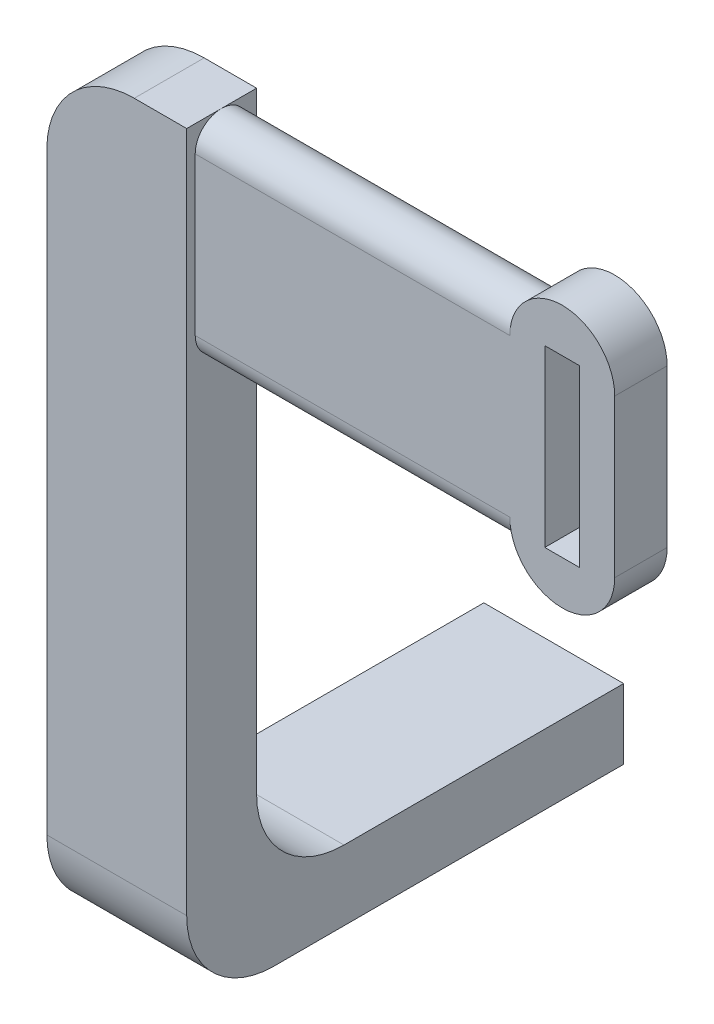
ISO-10303-21;
HEADER;
FILE_DESCRIPTION(('STEP AP214'),'2;1');
FILE_NAME('part.step','',(''),(''),'','','');
FILE_SCHEMA(('AUTOMOTIVE_DESIGN { 1 0 10303 214 1 1 1 1 }'));
ENDSEC;
DATA;
#1=APPLICATION_CONTEXT('core data for automotive mechanical design processes');
#2=APPLICATION_PROTOCOL_DEFINITION('international standard','automotive_design',2000,#1);
#3=PRODUCT_CONTEXT('',#1,'mechanical');
#4=PRODUCT('Part','Part','',(#3));
#5=PRODUCT_RELATED_PRODUCT_CATEGORY('part','',(#4));
#6=PRODUCT_DEFINITION_FORMATION('','',#4);
#7=PRODUCT_DEFINITION_CONTEXT('part definition',#1,'design');
#8=PRODUCT_DEFINITION('design','',#6,#7);
#9=PRODUCT_DEFINITION_SHAPE('','',#8);
#10=(LENGTH_UNIT() NAMED_UNIT(*) SI_UNIT(.MILLI.,.METRE.));
#11=(NAMED_UNIT(*) PLANE_ANGLE_UNIT() SI_UNIT($,.RADIAN.));
#12=(NAMED_UNIT(*) SI_UNIT($,.STERADIAN.) SOLID_ANGLE_UNIT());
#13=UNCERTAINTY_MEASURE_WITH_UNIT(LENGTH_MEASURE(1.E-05),#10,'distance_accuracy_value','');
#14=(GEOMETRIC_REPRESENTATION_CONTEXT(3) GLOBAL_UNCERTAINTY_ASSIGNED_CONTEXT((#13)) GLOBAL_UNIT_ASSIGNED_CONTEXT((#10,
#11,#12)) REPRESENTATION_CONTEXT('',''));
#15=CARTESIAN_POINT('',(0.,0.,0.));
#16=DIRECTION('',(0.,0.,1.));
#17=DIRECTION('',(1.,0.,0.));
#18=AXIS2_PLACEMENT_3D('',#15,#16,#17);
#19=CARTESIAN_POINT('',(50.,81.,49.0252352163252));
#20=DIRECTION('',(0.,0.,-1.));
#21=DIRECTION('',(-1.,0.,0.));
#22=AXIS2_PLACEMENT_3D('',#19,#20,#21);
#23=PLANE('',#22);
#24=CARTESIAN_POINT('',(50.,81.,49.0252352163253));
#25=DIRECTION('',(0.,0.,-1.));
#26=DIRECTION('',(0.,1.,0.));
#27=AXIS2_PLACEMENT_3D('',#24,#25,#26);
#28=CIRCLE('',#27,6.);
#29=CARTESIAN_POINT('',(44.,81.,49.0252352163252));
#30=VERTEX_POINT('',#29);
#31=CARTESIAN_POINT('',(56.,81.,49.0252352163253));
#32=VERTEX_POINT('',#31);
#33=EDGE_CURVE('E239',#30,#32,#28,.T.);
#34=ORIENTED_EDGE('',*,*,#33,.F.);
#35=DIRECTION('',(-1.,0.,0.));
#36=VECTOR('',#35,1.);
#37=CARTESIAN_POINT('',(50.,81.,49.0252352163252));
#38=LINE('',#37,#36);
#39=CARTESIAN_POINT('',(8.,81.,49.0252352163252));
#40=VERTEX_POINT('',#39);
#41=EDGE_CURVE('E396',#30,#40,#38,.T.);
#42=ORIENTED_EDGE('',*,*,#41,.T.);
#43=DIRECTION('',(0.,-1.,0.));
#44=VECTOR('',#43,1.);
#45=CARTESIAN_POINT('',(8.,81.,49.0252352163252));
#46=LINE('',#45,#44);
#47=CARTESIAN_POINT('',(8.,63.,49.0252352163252));
#48=VERTEX_POINT('',#47);
#49=EDGE_CURVE('E340',#40,#48,#46,.T.);
#50=ORIENTED_EDGE('',*,*,#49,.T.);
#51=DIRECTION('',(-1.,0.,0.));
#52=VECTOR('',#51,1.);
#53=CARTESIAN_POINT('',(50.,63.,49.0252352163252));
#54=LINE('',#53,#52);
#55=CARTESIAN_POINT('',(44.,63.,49.0252352163252));
#56=VERTEX_POINT('',#55);
#57=EDGE_CURVE('E336',#56,#48,#54,.T.);
#58=ORIENTED_EDGE('',*,*,#57,.F.);
#59=CARTESIAN_POINT('',(50.,63.,49.0252352163253));
#60=DIRECTION('',(0.,0.,-1.));
#61=DIRECTION('',(0.,1.,0.));
#62=AXIS2_PLACEMENT_3D('',#59,#60,#61);
#63=CIRCLE('',#62,6.);
#64=CARTESIAN_POINT('',(56.,63.,49.0252352163253));
#65=VERTEX_POINT('',#64);
#66=EDGE_CURVE('E236',#65,#56,#63,.T.);
#67=ORIENTED_EDGE('',*,*,#66,.F.);
#68=DIRECTION('',(0.,-1.,0.));
#69=VECTOR('',#68,1.);
#70=CARTESIAN_POINT('',(56.,63.,49.0252352163253));
#71=LINE('',#70,#69);
#72=EDGE_CURVE('E243',#32,#65,#71,.T.);
#73=ORIENTED_EDGE('',*,*,#72,.F.);
#74=EDGE_LOOP('',(#34,#42,#50,#58,#67,#73));
#75=FACE_BOUND('',#74,.T.);
#76=DIRECTION('',(1.,0.,0.));
#77=VECTOR('',#76,1.);
#78=CARTESIAN_POINT('',(48.,82.,49.0252352163252));
#79=LINE('',#78,#77);
#80=CARTESIAN_POINT('',(48.,82.,49.0252352163252));
#81=VERTEX_POINT('',#80);
#82=CARTESIAN_POINT('',(52.,82.,49.0252352163252));
#83=VERTEX_POINT('',#82);
#84=EDGE_CURVE('E224',#81,#83,#79,.T.);
#85=ORIENTED_EDGE('',*,*,#84,.T.);
#86=DIRECTION('',(0.,-1.,0.));
#87=VECTOR('',#86,1.);
#88=CARTESIAN_POINT('',(52.,82.,49.0252352163252));
#89=LINE('',#88,#87);
#90=CARTESIAN_POINT('',(52.,62.,49.0252352163252));
#91=VERTEX_POINT('',#90);
#92=EDGE_CURVE('E212',#83,#91,#89,.T.);
#93=ORIENTED_EDGE('',*,*,#92,.T.);
#94=DIRECTION('',(1.,0.,0.));
#95=VECTOR('',#94,1.);
#96=CARTESIAN_POINT('',(48.,62.,49.0252352163252));
#97=LINE('',#96,#95);
#98=CARTESIAN_POINT('',(48.,62.,49.0252352163252));
#99=VERTEX_POINT('',#98);
#100=EDGE_CURVE('E227',#99,#91,#97,.T.);
#101=ORIENTED_EDGE('',*,*,#100,.F.);
#102=DIRECTION('',(0.,-1.,0.));
#103=VECTOR('',#102,1.);
#104=CARTESIAN_POINT('',(48.,82.,49.0252352163252));
#105=LINE('',#104,#103);
#106=EDGE_CURVE('E206',#81,#99,#105,.T.);
#107=ORIENTED_EDGE('',*,*,#106,.F.);
#108=EDGE_LOOP('',(#85,#93,#101,#107));
#109=FACE_BOUND('',#108,.T.);
#110=ADVANCED_FACE('F38',(#75,#109),#23,.F.);
#111=CARTESIAN_POINT('',(50.,81.,43.0252352163252));
#112=DIRECTION('',(0.,0.,1.));
#113=DIRECTION('',(1.,0.,0.));
#114=AXIS2_PLACEMENT_3D('',#111,#112,#113);
#115=PLANE('',#114);
#116=DIRECTION('',(-1.,0.,0.));
#117=VECTOR('',#116,1.);
#118=CARTESIAN_POINT('',(50.,81.,43.0252352163252));
#119=LINE('',#118,#117);
#120=CARTESIAN_POINT('',(44.,81.,43.0252352163252));
#121=VERTEX_POINT('',#120);
#122=CARTESIAN_POINT('',(8.,81.,43.0252352163252));
#123=VERTEX_POINT('',#122);
#124=EDGE_CURVE('E331',#121,#123,#119,.T.);
#125=ORIENTED_EDGE('',*,*,#124,.F.);
#126=CARTESIAN_POINT('',(50.,81.,43.0252352163253));
#127=DIRECTION('',(0.,0.,-1.));
#128=DIRECTION('',(0.,1.,0.));
#129=AXIS2_PLACEMENT_3D('',#126,#127,#128);
#130=CIRCLE('',#129,6.);
#131=CARTESIAN_POINT('',(56.,81.,43.0252352163253));
#132=VERTEX_POINT('',#131);
#133=EDGE_CURVE('E249',#121,#132,#130,.T.);
#134=ORIENTED_EDGE('',*,*,#133,.T.);
#135=DIRECTION('',(0.,-1.,0.));
#136=VECTOR('',#135,1.);
#137=CARTESIAN_POINT('',(56.,63.,43.0252352163253));
#138=LINE('',#137,#136);
#139=CARTESIAN_POINT('',(56.,63.,43.0252352163253));
#140=VERTEX_POINT('',#139);
#141=EDGE_CURVE('E240',#132,#140,#138,.T.);
#142=ORIENTED_EDGE('',*,*,#141,.T.);
#143=CARTESIAN_POINT('',(50.,63.,43.0252352163253));
#144=DIRECTION('',(0.,0.,-1.));
#145=DIRECTION('',(0.,1.,0.));
#146=AXIS2_PLACEMENT_3D('',#143,#144,#145);
#147=CIRCLE('',#146,6.);
#148=CARTESIAN_POINT('',(44.,63.,43.0252352163252));
#149=VERTEX_POINT('',#148);
#150=EDGE_CURVE('E213',#140,#149,#147,.T.);
#151=ORIENTED_EDGE('',*,*,#150,.T.);
#152=DIRECTION('',(-1.,0.,0.));
#153=VECTOR('',#152,1.);
#154=CARTESIAN_POINT('',(50.,63.,43.0252352163252));
#155=LINE('',#154,#153);
#156=CARTESIAN_POINT('',(8.,63.,43.0252352163252));
#157=VERTEX_POINT('',#156);
#158=EDGE_CURVE('E534',#149,#157,#155,.T.);
#159=ORIENTED_EDGE('',*,*,#158,.T.);
#160=DIRECTION('',(0.,1.,0.));
#161=VECTOR('',#160,1.);
#162=CARTESIAN_POINT('',(8.,81.,43.0252352163252));
#163=LINE('',#162,#161);
#164=EDGE_CURVE('E529',#157,#123,#163,.T.);
#165=ORIENTED_EDGE('',*,*,#164,.T.);
#166=EDGE_LOOP('',(#125,#134,#142,#151,#159,#165));
#167=FACE_BOUND('',#166,.T.);
#168=DIRECTION('',(1.,0.,0.));
#169=VECTOR('',#168,1.);
#170=CARTESIAN_POINT('',(48.,82.,43.0252352163252));
#171=LINE('',#170,#169);
#172=CARTESIAN_POINT('',(48.,82.,43.0252352163252));
#173=VERTEX_POINT('',#172);
#174=CARTESIAN_POINT('',(52.,82.,43.0252352163252));
#175=VERTEX_POINT('',#174);
#176=EDGE_CURVE('E194',#173,#175,#171,.T.);
#177=ORIENTED_EDGE('',*,*,#176,.F.);
#178=DIRECTION('',(0.,-1.,0.));
#179=VECTOR('',#178,1.);
#180=CARTESIAN_POINT('',(48.,82.,43.0252352163252));
#181=LINE('',#180,#179);
#182=CARTESIAN_POINT('',(48.,62.,43.0252352163252));
#183=VERTEX_POINT('',#182);
#184=EDGE_CURVE('E220',#173,#183,#181,.T.);
#185=ORIENTED_EDGE('',*,*,#184,.T.);
#186=DIRECTION('',(1.,0.,0.));
#187=VECTOR('',#186,1.);
#188=CARTESIAN_POINT('',(48.,62.,43.0252352163252));
#189=LINE('',#188,#187);
#190=CARTESIAN_POINT('',(52.,62.,43.0252352163252));
#191=VERTEX_POINT('',#190);
#192=EDGE_CURVE('E218',#183,#191,#189,.T.);
#193=ORIENTED_EDGE('',*,*,#192,.T.);
#194=DIRECTION('',(0.,-1.,0.));
#195=VECTOR('',#194,1.);
#196=CARTESIAN_POINT('',(52.,82.,43.0252352163252));
#197=LINE('',#196,#195);
#198=EDGE_CURVE('E205',#175,#191,#197,.T.);
#199=ORIENTED_EDGE('',*,*,#198,.F.);
#200=EDGE_LOOP('',(#177,#185,#193,#199));
#201=FACE_BOUND('',#200,.T.);
#202=ADVANCED_FACE('F217',(#167,#201),#115,.F.);
#203=CARTESIAN_POINT('',(-8.,-4.,50.));
#204=DIRECTION('',(0.,1.,0.));
#205=DIRECTION('',(0.,0.,1.));
#206=AXIS2_PLACEMENT_3D('',#203,#204,#205);
#207=PLANE('',#206);
#208=DIRECTION('',(0.,0.,-1.));
#209=VECTOR('',#208,1.);
#210=CARTESIAN_POINT('',(8.,-4.,50.));
#211=LINE('',#210,#209);
#212=CARTESIAN_POINT('',(8.,-4.,40.));
#213=VERTEX_POINT('',#212);
#214=CARTESIAN_POINT('',(8.,-4.,0.));
#215=VERTEX_POINT('',#214);
#216=EDGE_CURVE('E352',#213,#215,#211,.T.);
#217=ORIENTED_EDGE('',*,*,#216,.F.);
#218=DIRECTION('',(1.,0.,0.));
#219=VECTOR('',#218,1.);
#220=CARTESIAN_POINT('',(-8.,-4.,40.));
#221=LINE('',#220,#219);
#222=CARTESIAN_POINT('',(-8.,-4.,40.));
#223=VERTEX_POINT('',#222);
#224=EDGE_CURVE('E363',#213,#223,#221,.F.);
#225=ORIENTED_EDGE('',*,*,#224,.T.);
#226=DIRECTION('',(0.,0.,-1.));
#227=VECTOR('',#226,1.);
#228=CARTESIAN_POINT('',(-8.,-4.,50.));
#229=LINE('',#228,#227);
#230=CARTESIAN_POINT('',(-8.,-4.,0.));
#231=VERTEX_POINT('',#230);
#232=EDGE_CURVE('E348',#223,#231,#229,.T.);
#233=ORIENTED_EDGE('',*,*,#232,.T.);
#234=DIRECTION('',(1.,0.,0.));
#235=VECTOR('',#234,1.);
#236=CARTESIAN_POINT('',(-8.,-4.,0.));
#237=LINE('',#236,#235);
#238=CARTESIAN_POINT('',(-4.,-4.,0.));
#239=VERTEX_POINT('',#238);
#240=EDGE_CURVE('E447',#231,#239,#237,.T.);
#241=ORIENTED_EDGE('',*,*,#240,.T.);
#242=DIRECTION('',(0.,0.,1.));
#243=VECTOR('',#242,1.);
#244=CARTESIAN_POINT('',(-4.,-4.,0.));
#245=LINE('',#244,#243);
#246=CARTESIAN_POINT('',(-4.,-4.,25.));
#247=VERTEX_POINT('',#246);
#248=EDGE_CURVE('E409',#239,#247,#245,.T.);
#249=ORIENTED_EDGE('',*,*,#248,.T.);
#250=DIRECTION('',(1.,0.,0.));
#251=VECTOR('',#250,1.);
#252=CARTESIAN_POINT('',(-4.,-4.,25.));
#253=LINE('',#252,#251);
#254=CARTESIAN_POINT('',(4.,-4.,25.));
#255=VERTEX_POINT('',#254);
#256=EDGE_CURVE('E424',#247,#255,#253,.T.);
#257=ORIENTED_EDGE('',*,*,#256,.T.);
#258=DIRECTION('',(0.,0.,-1.));
#259=VECTOR('',#258,1.);
#260=CARTESIAN_POINT('',(4.,-4.,0.));
#261=LINE('',#260,#259);
#262=CARTESIAN_POINT('',(4.,-4.,0.));
#263=VERTEX_POINT('',#262);
#264=EDGE_CURVE('E414',#255,#263,#261,.T.);
#265=ORIENTED_EDGE('',*,*,#264,.T.);
#266=EDGE_CURVE('E446',#263,#215,#237,.T.);
#267=ORIENTED_EDGE('',*,*,#266,.T.);
#268=EDGE_LOOP('',(#217,#225,#233,#241,#249,#257,#265,#267));
#269=FACE_BOUND('',#268,.T.);
#270=ADVANCED_FACE('F291',(#269),#207,.F.);
#271=CARTESIAN_POINT('',(0.,0.,0.));
#272=DIRECTION('',(0.,0.,1.));
#273=DIRECTION('',(1.,0.,0.));
#274=AXIS2_PLACEMENT_3D('',#271,#272,#273);
#275=PLANE('',#274);
#276=DIRECTION('',(0.,-1.,0.));
#277=VECTOR('',#276,1.);
#278=CARTESIAN_POINT('',(-4.,1.,0.));
#279=LINE('',#278,#277);
#280=CARTESIAN_POINT('',(-4.,1.,0.));
#281=VERTEX_POINT('',#280);
#282=EDGE_CURVE('E421',#281,#239,#279,.T.);
#283=ORIENTED_EDGE('',*,*,#282,.T.);
#284=ORIENTED_EDGE('',*,*,#240,.F.);
#285=DIRECTION('',(0.,-1.,0.));
#286=VECTOR('',#285,1.);
#287=CARTESIAN_POINT('',(-8.,4.,0.));
#288=LINE('',#287,#286);
#289=CARTESIAN_POINT('',(-8.,4.,0.));
#290=VERTEX_POINT('',#289);
#291=EDGE_CURVE('E438',#290,#231,#288,.T.);
#292=ORIENTED_EDGE('',*,*,#291,.F.);
#293=DIRECTION('',(1.,0.,0.));
#294=VECTOR('',#293,1.);
#295=CARTESIAN_POINT('',(-8.,4.,0.));
#296=LINE('',#295,#294);
#297=CARTESIAN_POINT('',(8.,4.,0.));
#298=VERTEX_POINT('',#297);
#299=EDGE_CURVE('E441',#290,#298,#296,.T.);
#300=ORIENTED_EDGE('',*,*,#299,.T.);
#301=DIRECTION('',(0.,-1.,0.));
#302=VECTOR('',#301,1.);
#303=CARTESIAN_POINT('',(8.,4.,0.));
#304=LINE('',#303,#302);
#305=EDGE_CURVE('E449',#298,#215,#304,.T.);
#306=ORIENTED_EDGE('',*,*,#305,.T.);
#307=ORIENTED_EDGE('',*,*,#266,.F.);
#308=DIRECTION('',(0.,-1.,0.));
#309=VECTOR('',#308,1.);
#310=CARTESIAN_POINT('',(4.,1.,0.));
#311=LINE('',#310,#309);
#312=CARTESIAN_POINT('',(4.,1.,0.));
#313=VERTEX_POINT('',#312);
#314=EDGE_CURVE('E431',#313,#263,#311,.T.);
#315=ORIENTED_EDGE('',*,*,#314,.F.);
#316=DIRECTION('',(-1.,0.,0.));
#317=VECTOR('',#316,1.);
#318=CARTESIAN_POINT('',(-4.,1.,0.));
#319=LINE('',#318,#317);
#320=EDGE_CURVE('E418',#313,#281,#319,.T.);
#321=ORIENTED_EDGE('',*,*,#320,.T.);
#322=EDGE_LOOP('',(#283,#284,#292,#300,#306,#307,#315,#321));
#323=FACE_BOUND('',#322,.T.);
#324=ADVANCED_FACE('F469',(#323),#275,.F.);
#325=CARTESIAN_POINT('',(-8.,4.,50.));
#326=DIRECTION('',(1.,0.,0.));
#327=DIRECTION('',(0.,0.,-1.));
#328=AXIS2_PLACEMENT_3D('',#325,#326,#327);
#329=PLANE('',#328);
#330=DIRECTION('',(0.,-1.,0.));
#331=VECTOR('',#330,1.);
#332=CARTESIAN_POINT('',(-8.,4.,50.));
#333=LINE('',#332,#331);
#334=CARTESIAN_POINT('',(-8.,74.,50.));
#335=VERTEX_POINT('',#334);
#336=CARTESIAN_POINT('',(-8.,6.,50.));
#337=VERTEX_POINT('',#336);
#338=EDGE_CURVE('E439',#335,#337,#333,.T.);
#339=ORIENTED_EDGE('',*,*,#338,.F.);
#340=DIRECTION('',(0.,0.,1.));
#341=VECTOR('',#340,1.);
#342=CARTESIAN_POINT('',(-8.,74.,50.));
#343=LINE('',#342,#341);
#344=CARTESIAN_POINT('',(-8.,74.,42.));
#345=VERTEX_POINT('',#344);
#346=EDGE_CURVE('E46',#335,#345,#343,.F.);
#347=ORIENTED_EDGE('',*,*,#346,.T.);
#348=DIRECTION('',(0.,-1.,0.));
#349=VECTOR('',#348,1.);
#350=CARTESIAN_POINT('',(-8.,84.,42.));
#351=LINE('',#350,#349);
#352=CARTESIAN_POINT('',(-8.,14.,42.));
#353=VERTEX_POINT('',#352);
#354=EDGE_CURVE('E404',#345,#353,#351,.T.);
#355=ORIENTED_EDGE('',*,*,#354,.T.);
#356=CARTESIAN_POINT('',(-8.,14.,32.));
#357=DIRECTION('',(1.,0.,0.));
#358=DIRECTION('',(0.,0.,-1.));
#359=AXIS2_PLACEMENT_3D('',#356,#357,#358);
#360=CIRCLE('',#359,10.);
#361=CARTESIAN_POINT('',(-8.,4.,32.));
#362=VERTEX_POINT('',#361);
#363=EDGE_CURVE('E373',#353,#362,#360,.T.);
#364=ORIENTED_EDGE('',*,*,#363,.T.);
#365=DIRECTION('',(0.,0.,-1.));
#366=VECTOR('',#365,1.);
#367=CARTESIAN_POINT('',(-8.,4.,50.));
#368=LINE('',#367,#366);
#369=EDGE_CURVE('E443',#362,#290,#368,.T.);
#370=ORIENTED_EDGE('',*,*,#369,.T.);
#371=ORIENTED_EDGE('',*,*,#291,.T.);
#372=ORIENTED_EDGE('',*,*,#232,.F.);
#373=CARTESIAN_POINT('',(-8.,6.,40.));
#374=DIRECTION('',(1.,0.,0.));
#375=DIRECTION('',(0.,0.,-1.));
#376=AXIS2_PLACEMENT_3D('',#373,#374,#375);
#377=CIRCLE('',#376,10.);
#378=EDGE_CURVE('E365',#223,#337,#377,.F.);
#379=ORIENTED_EDGE('',*,*,#378,.T.);
#380=EDGE_LOOP('',(#339,#347,#355,#364,#370,#371,#372,#379));
#381=FACE_BOUND('',#380,.T.);
#382=ADVANCED_FACE('F470',(#381),#329,.F.);
#383=CARTESIAN_POINT('',(8.,4.,50.));
#384=DIRECTION('',(1.,0.,0.));
#385=DIRECTION('',(0.,0.,-1.));
#386=AXIS2_PLACEMENT_3D('',#383,#384,#385);
#387=PLANE('',#386);
#388=DIRECTION('',(0.,-1.,0.));
#389=VECTOR('',#388,1.);
#390=CARTESIAN_POINT('',(8.,4.,50.));
#391=LINE('',#390,#389);
#392=CARTESIAN_POINT('',(8.,84.,50.));
#393=VERTEX_POINT('',#392);
#394=CARTESIAN_POINT('',(8.,6.,50.));
#395=VERTEX_POINT('',#394);
#396=EDGE_CURVE('E393',#393,#395,#391,.T.);
#397=ORIENTED_EDGE('',*,*,#396,.T.);
#398=CARTESIAN_POINT('',(8.,6.,40.));
#399=DIRECTION('',(1.,0.,0.));
#400=DIRECTION('',(0.,0.,-1.));
#401=AXIS2_PLACEMENT_3D('',#398,#399,#400);
#402=CIRCLE('',#401,10.);
#403=EDGE_CURVE('E350',#395,#213,#402,.T.);
#404=ORIENTED_EDGE('',*,*,#403,.T.);
#405=ORIENTED_EDGE('',*,*,#216,.T.);
#406=ORIENTED_EDGE('',*,*,#305,.F.);
#407=DIRECTION('',(0.,0.,-1.));
#408=VECTOR('',#407,1.);
#409=CARTESIAN_POINT('',(8.,4.,50.));
#410=LINE('',#409,#408);
#411=CARTESIAN_POINT('',(8.,4.,32.));
#412=VERTEX_POINT('',#411);
#413=EDGE_CURVE('E358',#412,#298,#410,.T.);
#414=ORIENTED_EDGE('',*,*,#413,.F.);
#415=CARTESIAN_POINT('',(8.,14.,32.));
#416=DIRECTION('',(1.,0.,0.));
#417=DIRECTION('',(0.,0.,-1.));
#418=AXIS2_PLACEMENT_3D('',#415,#416,#417);
#419=CIRCLE('',#418,10.);
#420=CARTESIAN_POINT('',(8.,14.,42.));
#421=VERTEX_POINT('',#420);
#422=EDGE_CURVE('E375',#412,#421,#419,.F.);
#423=ORIENTED_EDGE('',*,*,#422,.T.);
#424=DIRECTION('',(0.,-1.,0.));
#425=VECTOR('',#424,1.);
#426=CARTESIAN_POINT('',(8.,84.,42.));
#427=LINE('',#426,#425);
#428=CARTESIAN_POINT('',(8.,84.,42.));
#429=VERTEX_POINT('',#428);
#430=EDGE_CURVE('E406',#429,#421,#427,.T.);
#431=ORIENTED_EDGE('',*,*,#430,.F.);
#432=DIRECTION('',(0.,0.,-1.));
#433=VECTOR('',#432,1.);
#434=CARTESIAN_POINT('',(8.,84.,50.));
#435=LINE('',#434,#433);
#436=CARTESIAN_POINT('',(8.,84.,46.0252352163252));
#437=VERTEX_POINT('',#436);
#438=EDGE_CURVE('E395',#437,#429,#435,.T.);
#439=ORIENTED_EDGE('',*,*,#438,.F.);
#440=CARTESIAN_POINT('',(8.,81.,46.0252352163252));
#441=DIRECTION('',(1.,0.,0.));
#442=DIRECTION('',(0.,0.,-1.));
#443=AXIS2_PLACEMENT_3D('',#440,#441,#442);
#444=CIRCLE('',#443,3.);
#445=EDGE_CURVE('E338',#123,#437,#444,.T.);
#446=ORIENTED_EDGE('',*,*,#445,.F.);
#447=ORIENTED_EDGE('',*,*,#164,.F.);
#448=CARTESIAN_POINT('',(8.,63.,46.0252352163252));
#449=DIRECTION('',(1.,0.,0.));
#450=DIRECTION('',(0.,0.,-1.));
#451=AXIS2_PLACEMENT_3D('',#448,#449,#450);
#452=CIRCLE('',#451,3.);
#453=EDGE_CURVE('E345',#48,#157,#452,.T.);
#454=ORIENTED_EDGE('',*,*,#453,.F.);
#455=ORIENTED_EDGE('',*,*,#49,.F.);
#456=EDGE_CURVE('E341',#437,#40,#444,.T.);
#457=ORIENTED_EDGE('',*,*,#456,.F.);
#458=EDGE_CURVE('E398',#393,#437,#435,.T.);
#459=ORIENTED_EDGE('',*,*,#458,.F.);
#460=EDGE_LOOP('',(#397,#404,#405,#406,#414,#423,#431,#439,#446,#447,#454,#455,#457,#459));
#461=FACE_BOUND('',#460,.T.);
#462=ADVANCED_FACE('F463',(#461),#387,.T.);
#463=CARTESIAN_POINT('',(-8.,4.,50.));
#464=DIRECTION('',(0.,1.,0.));
#465=DIRECTION('',(0.,0.,1.));
#466=AXIS2_PLACEMENT_3D('',#463,#464,#465);
#467=PLANE('',#466);
#468=ORIENTED_EDGE('',*,*,#369,.F.);
#469=DIRECTION('',(-1.,0.,0.));
#470=VECTOR('',#469,1.);
#471=CARTESIAN_POINT('',(-8.,4.,32.));
#472=LINE('',#471,#470);
#473=EDGE_CURVE('E371',#362,#412,#472,.F.);
#474=ORIENTED_EDGE('',*,*,#473,.T.);
#475=ORIENTED_EDGE('',*,*,#413,.T.);
#476=ORIENTED_EDGE('',*,*,#299,.F.);
#477=EDGE_LOOP('',(#468,#474,#475,#476));
#478=FACE_BOUND('',#477,.T.);
#479=ADVANCED_FACE('F459',(#478),#467,.T.);
#480=CARTESIAN_POINT('',(0.,0.,50.));
#481=DIRECTION('',(0.,0.,1.));
#482=DIRECTION('',(1.,0.,0.));
#483=AXIS2_PLACEMENT_3D('',#480,#481,#482);
#484=PLANE('',#483);
#485=DIRECTION('',(1.,0.,0.));
#486=VECTOR('',#485,1.);
#487=CARTESIAN_POINT('',(-8.,84.,50.));
#488=LINE('',#487,#486);
#489=CARTESIAN_POINT('',(2.,84.,50.));
#490=VERTEX_POINT('',#489);
#491=EDGE_CURVE('E385',#490,#393,#488,.T.);
#492=ORIENTED_EDGE('',*,*,#491,.F.);
#493=CARTESIAN_POINT('',(2.,74.,50.));
#494=DIRECTION('',(0.,0.,1.));
#495=DIRECTION('',(1.,0.,0.));
#496=AXIS2_PLACEMENT_3D('',#493,#494,#495);
#497=CIRCLE('',#496,10.);
#498=EDGE_CURVE('E60',#490,#335,#497,.T.);
#499=ORIENTED_EDGE('',*,*,#498,.T.);
#500=ORIENTED_EDGE('',*,*,#338,.T.);
#501=DIRECTION('',(1.,0.,0.));
#502=VECTOR('',#501,1.);
#503=CARTESIAN_POINT('',(8.,6.,50.));
#504=LINE('',#503,#502);
#505=EDGE_CURVE('E347',#337,#395,#504,.T.);
#506=ORIENTED_EDGE('',*,*,#505,.T.);
#507=ORIENTED_EDGE('',*,*,#396,.F.);
#508=EDGE_LOOP('',(#492,#499,#500,#506,#507));
#509=FACE_BOUND('',#508,.T.);
#510=ADVANCED_FACE('F391',(#509),#484,.T.);
#511=CARTESIAN_POINT('',(-4.,1.,0.));
#512=DIRECTION('',(1.,0.,0.));
#513=DIRECTION('',(0.,0.,-1.));
#514=AXIS2_PLACEMENT_3D('',#511,#512,#513);
#515=PLANE('',#514);
#516=ORIENTED_EDGE('',*,*,#248,.F.);
#517=ORIENTED_EDGE('',*,*,#282,.F.);
#518=DIRECTION('',(0.,0.,1.));
#519=VECTOR('',#518,1.);
#520=CARTESIAN_POINT('',(-4.,1.,0.));
#521=LINE('',#520,#519);
#522=CARTESIAN_POINT('',(-4.,1.,25.));
#523=VERTEX_POINT('',#522);
#524=EDGE_CURVE('E410',#281,#523,#521,.T.);
#525=ORIENTED_EDGE('',*,*,#524,.T.);
#526=DIRECTION('',(0.,-1.,0.));
#527=VECTOR('',#526,1.);
#528=CARTESIAN_POINT('',(-4.,1.,25.));
#529=LINE('',#528,#527);
#530=EDGE_CURVE('E435',#523,#247,#529,.T.);
#531=ORIENTED_EDGE('',*,*,#530,.T.);
#532=EDGE_LOOP('',(#516,#517,#525,#531));
#533=FACE_BOUND('',#532,.T.);
#534=ADVANCED_FACE('F502',(#533),#515,.T.);
#535=CARTESIAN_POINT('',(-4.,1.,25.));
#536=DIRECTION('',(0.,0.,-1.));
#537=DIRECTION('',(-1.,0.,0.));
#538=AXIS2_PLACEMENT_3D('',#535,#536,#537);
#539=PLANE('',#538);
#540=ORIENTED_EDGE('',*,*,#256,.F.);
#541=ORIENTED_EDGE('',*,*,#530,.F.);
#542=DIRECTION('',(1.,0.,0.));
#543=VECTOR('',#542,1.);
#544=CARTESIAN_POINT('',(-4.,1.,25.));
#545=LINE('',#544,#543);
#546=CARTESIAN_POINT('',(4.,1.,25.));
#547=VERTEX_POINT('',#546);
#548=EDGE_CURVE('E413',#523,#547,#545,.T.);
#549=ORIENTED_EDGE('',*,*,#548,.T.);
#550=DIRECTION('',(0.,-1.,0.));
#551=VECTOR('',#550,1.);
#552=CARTESIAN_POINT('',(4.,1.,25.));
#553=LINE('',#552,#551);
#554=EDGE_CURVE('E433',#547,#255,#553,.T.);
#555=ORIENTED_EDGE('',*,*,#554,.T.);
#556=EDGE_LOOP('',(#540,#541,#549,#555));
#557=FACE_BOUND('',#556,.T.);
#558=ADVANCED_FACE('F505',(#557),#539,.T.);
#559=CARTESIAN_POINT('',(4.,1.,0.));
#560=DIRECTION('',(-1.,0.,0.));
#561=DIRECTION('',(0.,0.,1.));
#562=AXIS2_PLACEMENT_3D('',#559,#560,#561);
#563=PLANE('',#562);
#564=ORIENTED_EDGE('',*,*,#264,.F.);
#565=ORIENTED_EDGE('',*,*,#554,.F.);
#566=DIRECTION('',(0.,0.,-1.));
#567=VECTOR('',#566,1.);
#568=CARTESIAN_POINT('',(4.,1.,0.));
#569=LINE('',#568,#567);
#570=EDGE_CURVE('E416',#547,#313,#569,.T.);
#571=ORIENTED_EDGE('',*,*,#570,.T.);
#572=ORIENTED_EDGE('',*,*,#314,.T.);
#573=EDGE_LOOP('',(#564,#565,#571,#572));
#574=FACE_BOUND('',#573,.T.);
#575=ADVANCED_FACE('F509',(#574),#563,.T.);
#576=CARTESIAN_POINT('',(0.,1.,0.));
#577=DIRECTION('',(0.,1.,0.));
#578=DIRECTION('',(0.,0.,1.));
#579=AXIS2_PLACEMENT_3D('',#576,#577,#578);
#580=PLANE('',#579);
#581=ORIENTED_EDGE('',*,*,#524,.F.);
#582=ORIENTED_EDGE('',*,*,#320,.F.);
#583=ORIENTED_EDGE('',*,*,#570,.F.);
#584=ORIENTED_EDGE('',*,*,#548,.F.);
#585=EDGE_LOOP('',(#581,#582,#583,#584));
#586=FACE_BOUND('',#585,.T.);
#587=ADVANCED_FACE('F513',(#586),#580,.F.);
#588=CARTESIAN_POINT('',(-8.,84.,42.));
#589=DIRECTION('',(0.,0.,1.));
#590=DIRECTION('',(1.,0.,0.));
#591=AXIS2_PLACEMENT_3D('',#588,#589,#590);
#592=PLANE('',#591);
#593=ORIENTED_EDGE('',*,*,#354,.F.);
#594=CARTESIAN_POINT('',(2.,74.,42.));
#595=DIRECTION('',(0.,0.,1.));
#596=DIRECTION('',(1.,0.,0.));
#597=AXIS2_PLACEMENT_3D('',#594,#595,#596);
#598=CIRCLE('',#597,10.);
#599=CARTESIAN_POINT('',(2.,84.,42.));
#600=VERTEX_POINT('',#599);
#601=EDGE_CURVE('E11',#345,#600,#598,.F.);
#602=ORIENTED_EDGE('',*,*,#601,.T.);
#603=DIRECTION('',(-1.,0.,0.));
#604=VECTOR('',#603,1.);
#605=CARTESIAN_POINT('',(-8.,84.,42.));
#606=LINE('',#605,#604);
#607=EDGE_CURVE('E388',#429,#600,#606,.T.);
#608=ORIENTED_EDGE('',*,*,#607,.F.);
#609=ORIENTED_EDGE('',*,*,#430,.T.);
#610=DIRECTION('',(-1.,0.,0.));
#611=VECTOR('',#610,1.);
#612=CARTESIAN_POINT('',(-8.,14.,42.));
#613=LINE('',#612,#611);
#614=EDGE_CURVE('E368',#421,#353,#613,.T.);
#615=ORIENTED_EDGE('',*,*,#614,.T.);
#616=EDGE_LOOP('',(#593,#602,#608,#609,#615));
#617=FACE_BOUND('',#616,.T.);
#618=ADVANCED_FACE('F479',(#617),#592,.F.);
#619=CARTESIAN_POINT('',(0.,84.,0.));
#620=DIRECTION('',(0.,-1.,0.));
#621=DIRECTION('',(0.,0.,-1.));
#622=AXIS2_PLACEMENT_3D('',#619,#620,#621);
#623=PLANE('',#622);
#624=ORIENTED_EDGE('',*,*,#607,.T.);
#625=DIRECTION('',(0.,0.,1.));
#626=VECTOR('',#625,1.);
#627=CARTESIAN_POINT('',(2.,84.,0.));
#628=LINE('',#627,#626);
#629=EDGE_CURVE('E377',#600,#490,#628,.T.);
#630=ORIENTED_EDGE('',*,*,#629,.T.);
#631=ORIENTED_EDGE('',*,*,#491,.T.);
#632=ORIENTED_EDGE('',*,*,#458,.T.);
#633=ORIENTED_EDGE('',*,*,#438,.T.);
#634=EDGE_LOOP('',(#624,#630,#631,#632,#633));
#635=FACE_BOUND('',#634,.T.);
#636=ADVANCED_FACE('F383',(#635),#623,.F.);
#637=CARTESIAN_POINT('',(50.,81.,46.0252352163252));
#638=DIRECTION('',(-1.,0.,0.));
#639=DIRECTION('',(0.,0.,1.));
#640=AXIS2_PLACEMENT_3D('',#637,#638,#639);
#641=CYLINDRICAL_SURFACE('',#640,3.);
#642=ORIENTED_EDGE('',*,*,#41,.F.);
#643=CARTESIAN_POINT('',(44.,81.,49.0252352163252));
#644=CARTESIAN_POINT('',(43.9999859431479,81.0791935142297,49.0252479384075));
#645=CARTESIAN_POINT('',(44.0015675297775,81.1583780145098,49.0220997677143));
#646=CARTESIAN_POINT('',(44.0078165302508,81.3161000322899,49.0095804589669));
#647=CARTESIAN_POINT('',(44.0124827048766,81.3946377967895,49.0002118199485));
#648=CARTESIAN_POINT('',(44.0247677991761,81.5501502962676,48.9754063372397));
#649=CARTESIAN_POINT('',(44.0323733005401,81.6271304849032,48.9599970651046));
#650=CARTESIAN_POINT('',(44.050333983838,81.7793311504577,48.9232999267121));
#651=CARTESIAN_POINT('',(44.0606893360922,81.8545515180625,48.9020116963204));
#652=CARTESIAN_POINT('',(44.0954923956325,82.0766331266901,48.8297003930256));
#653=CARTESIAN_POINT('',(44.1237044726322,82.2202415444621,48.7701776285063));
#654=CARTESIAN_POINT('',(44.1875897942736,82.4952986333516,48.630605102608));
#655=CARTESIAN_POINT('',(44.2232704888868,82.62673497251,48.5505348268576));
#656=CARTESIAN_POINT('',(44.3013141653527,82.8825243880921,48.3666778844016));
#657=CARTESIAN_POINT('',(44.343949585787,83.005979756186,48.2617567701608));
#658=CARTESIAN_POINT('',(44.4302043046155,83.2343479629372,48.0336660654038));
#659=CARTESIAN_POINT('',(44.4738242286276,83.3392486139634,47.9104845775014));
#660=CARTESIAN_POINT('',(44.5610370247465,83.5357691085504,47.6377493036384));
#661=CARTESIAN_POINT('',(44.6043650018186,83.625726122175,47.4868906611134));
#662=CARTESIAN_POINT('',(44.6621766031388,83.7403425096584,47.2492795170383));
#663=CARTESIAN_POINT('',(44.6802551254187,83.7751694774002,47.1681603473567));
#664=CARTESIAN_POINT('',(44.7133426790783,83.837693648472,47.0026325954009));
#665=CARTESIAN_POINT('',(44.72835352373,83.8653950661595,46.918225991631));
#666=CARTESIAN_POINT('',(44.753896441964,83.9118825502262,46.7518403383498));
#667=CARTESIAN_POINT('',(44.764641369412,83.9310999857977,46.6700142854117));
#668=CARTESIAN_POINT('',(44.7824217957381,83.9626349532063,46.50468409217));
#669=CARTESIAN_POINT('',(44.7894592622443,83.9749561452434,46.4211808664565));
#670=CARTESIAN_POINT('',(44.7995222379909,83.9925134854643,46.2532336453543));
#671=CARTESIAN_POINT('',(44.8025500726916,83.9977537404051,46.1687902239338));
#672=CARTESIAN_POINT('',(44.8044744656262,84.0010845687883,45.9997434879581));
#673=CARTESIAN_POINT('',(44.8033714179793,83.9991758243024,45.9151401894261));
#674=CARTESIAN_POINT('',(44.7946532579833,83.9840496231326,45.6824797096819));
#675=CARTESIAN_POINT('',(44.7827317920057,83.9633499383315,45.5349878544878));
#676=CARTESIAN_POINT('',(44.747717680128,83.9008219313133,45.2460384793637));
#677=CARTESIAN_POINT('',(44.7246217172793,83.8589873354144,45.1045827647292));
#678=CARTESIAN_POINT('',(44.669374683477,83.7546290239842,44.8275574620023));
#679=CARTESIAN_POINT('',(44.6370252478153,83.6916461531877,44.6922016892961));
#680=CARTESIAN_POINT('',(44.5668993438709,83.547128109023,44.4333338277885));
#681=CARTESIAN_POINT('',(44.5291202917953,83.4655840921107,44.3098274246774));
#682=CARTESIAN_POINT('',(44.4466062712288,83.2741988994997,44.061675500843));
#683=CARTESIAN_POINT('',(44.4015965734467,83.1620811344713,43.9388696977154));
#684=CARTESIAN_POINT('',(44.3135748604432,82.9186840220664,43.7130378131103));
#685=CARTESIAN_POINT('',(44.270563933257,82.7873943958445,43.6100224111426));
#686=CARTESIAN_POINT('',(44.188915831116,82.5014395781279,43.4221191874112));
#687=CARTESIAN_POINT('',(44.150578687564,82.3459664705608,43.3383091183642));
#688=CARTESIAN_POINT('',(44.101545297718,82.1023344880908,43.2336956097981));
#689=CARTESIAN_POINT('',(44.0866156171957,82.019409251829,43.2023466801408));
#690=CARTESIAN_POINT('',(44.0599936844942,81.8506519668071,43.1469948253656));
#691=CARTESIAN_POINT('',(44.0483003357333,81.7648209137294,43.1229894117182));
#692=CARTESIAN_POINT('',(44.0258501306411,81.567344267642,43.0771892603574));
#693=CARTESIAN_POINT('',(44.0162055407133,81.4550056151374,43.0577559816359));
#694=CARTESIAN_POINT('',(44.0065098677314,81.2851510658708,43.0382717537498));
#695=CARTESIAN_POINT('',(44.0040731526787,81.2282756210178,43.033387936717));
#696=CARTESIAN_POINT('',(44.0008169847668,81.1142727509983,43.0268687591504));
#697=CARTESIAN_POINT('',(43.9999981021824,81.0571452440906,43.0252345440777));
#698=CARTESIAN_POINT('',(44.,81.,43.0252352163252));
#699=B_SPLINE_CURVE_WITH_KNOTS('',3,(#643,#644,#645,#646,#647,#648,#649,#650,#651,#652,#653,
#654,#655,#656,#657,#658,#659,#660,#661,#662,#663,#664,#665,#666,#667,#668,#669,#670,#671,#672,
#673,#674,#675,#676,#677,#678,#679,#680,#681,#682,#683,#684,#685,#686,#687,#688,#689,#690,#691,
#692,#693,#694,#695,#696,#697,#698),.UNSPECIFIED.,.F.,.F.,(4,2,2,2,2,2,2,2,2,2,2,2,2,2,2,2,2,2,
2,2,2,2,2,2,2,2,2,4),(0.,0.23748722121864,0.474879091057443,0.71119980681767,0.94753516323445,
1.41922222141813,1.89138205060135,2.39186200163888,2.89266948097725,3.43234898408421,
3.70236462751273,3.97222020293529,4.2260685194832,4.47978197727261,4.73334822469419,
4.98689028048522,5.43282575429976,5.87889367733417,6.33535046902727,6.79202519860241,
7.30658195029048,7.8214155974475,8.36041301194786,8.62977435146565,8.89904430994226,
9.24127553351258,9.4125867286648,9.5839582990632),.UNSPECIFIED.);
#700=EDGE_CURVE('E256',#30,#121,#699,.T.);
#701=ORIENTED_EDGE('',*,*,#700,.T.);
#702=ORIENTED_EDGE('',*,*,#124,.T.);
#703=ORIENTED_EDGE('',*,*,#445,.T.);
#704=ORIENTED_EDGE('',*,*,#456,.T.);
#705=EDGE_LOOP('',(#642,#701,#702,#703,#704));
#706=FACE_BOUND('',#705,.T.);
#707=ADVANCED_FACE('F273',(#706),#641,.T.);
#708=CARTESIAN_POINT('',(50.,63.,46.0252352163252));
#709=DIRECTION('',(-1.,0.,0.));
#710=DIRECTION('',(0.,0.,1.));
#711=AXIS2_PLACEMENT_3D('',#708,#709,#710);
#712=CYLINDRICAL_SURFACE('',#711,3.);
#713=ORIENTED_EDGE('',*,*,#158,.F.);
#714=CARTESIAN_POINT('',(44.,63.,43.0252352163252));
#715=CARTESIAN_POINT('',(43.9999859431479,62.9208064857703,43.0252224942429));
#716=CARTESIAN_POINT('',(44.0015675297775,62.8416219854902,43.0283706649362));
#717=CARTESIAN_POINT('',(44.0078165302508,62.6838999677101,43.0408899736836));
#718=CARTESIAN_POINT('',(44.0124827048766,62.6053622032105,43.050258612702));
#719=CARTESIAN_POINT('',(44.0247677991761,62.4498497037324,43.0750640954107));
#720=CARTESIAN_POINT('',(44.0323733005401,62.3728695150968,43.0904733675459));
#721=CARTESIAN_POINT('',(44.050333983838,62.2206688495423,43.1271705059384));
#722=CARTESIAN_POINT('',(44.0606893360922,62.1454484819375,43.1484587363301));
#723=CARTESIAN_POINT('',(44.0954923956325,61.9233668733099,43.2207700396249));
#724=CARTESIAN_POINT('',(44.1237044726322,61.7797584555379,43.2802928041442));
#725=CARTESIAN_POINT('',(44.1875897942736,61.5047013666484,43.4198653300425));
#726=CARTESIAN_POINT('',(44.2232704888868,61.37326502749,43.4999356057929));
#727=CARTESIAN_POINT('',(44.3013141653527,61.1174756119079,43.6837925482489));
#728=CARTESIAN_POINT('',(44.343949585787,60.994020243814,43.7887136624897));
#729=CARTESIAN_POINT('',(44.4302043046155,60.7656520370628,44.0168043672467));
#730=CARTESIAN_POINT('',(44.4738242286276,60.6607513860366,44.1399858551491));
#731=CARTESIAN_POINT('',(44.5610370247465,60.4642308914496,44.4127211290121));
#732=CARTESIAN_POINT('',(44.6043650018186,60.374273877825,44.5635797715371));
#733=CARTESIAN_POINT('',(44.6621766031388,60.2596574903416,44.8011909156122));
#734=CARTESIAN_POINT('',(44.6802551254187,60.2248305225998,44.8823100852938));
#735=CARTESIAN_POINT('',(44.7133426790783,60.162306351528,45.0478378372495));
#736=CARTESIAN_POINT('',(44.72835352373,60.1346049338405,45.1322444410195));
#737=CARTESIAN_POINT('',(44.753896441964,60.0881174497738,45.2986300943007));
#738=CARTESIAN_POINT('',(44.7646413694121,60.0689000142023,45.3804561472388));
#739=CARTESIAN_POINT('',(44.7824217957381,60.0373650467937,45.5457863404805));
#740=CARTESIAN_POINT('',(44.7894592622443,60.0250438547566,45.629289566194));
#741=CARTESIAN_POINT('',(44.7995222379909,60.0074865145357,45.7972367872962));
#742=CARTESIAN_POINT('',(44.8025500726916,60.0022462595949,45.8816802087166));
#743=CARTESIAN_POINT('',(44.8044744656262,59.9989154312117,46.0507269446924));
#744=CARTESIAN_POINT('',(44.8033714179793,60.0008241756977,46.1353302432244));
#745=CARTESIAN_POINT('',(44.7946532579833,60.0159503768674,46.3679907229685));
#746=CARTESIAN_POINT('',(44.7827317920057,60.0366500616685,46.5154825781626));
#747=CARTESIAN_POINT('',(44.747717680128,60.0991780686867,46.8044319532867));
#748=CARTESIAN_POINT('',(44.7246217172793,60.1410126645856,46.9458876679213));
#749=CARTESIAN_POINT('',(44.669374683477,60.2453709760158,47.2229129706482));
#750=CARTESIAN_POINT('',(44.6370252478153,60.3083538468123,47.3582687433544));
#751=CARTESIAN_POINT('',(44.5668993438709,60.452871890977,47.6171366048619));
#752=CARTESIAN_POINT('',(44.5291202917953,60.5344159078893,47.7406430079731));
#753=CARTESIAN_POINT('',(44.4466062712288,60.7258011005003,47.9887949318074));
#754=CARTESIAN_POINT('',(44.4015965734467,60.8379188655287,48.1116007349351));
#755=CARTESIAN_POINT('',(44.3135748604432,61.0813159779336,48.3374326195402));
#756=CARTESIAN_POINT('',(44.270563933257,61.2126056041555,48.4404480215078));
#757=CARTESIAN_POINT('',(44.188915831116,61.4985604218721,48.6283512452392));
#758=CARTESIAN_POINT('',(44.150578687564,61.6540335294392,48.7121613142862));
#759=CARTESIAN_POINT('',(44.101545297718,61.8976655119092,48.8167748228523));
#760=CARTESIAN_POINT('',(44.0866156171957,61.980590748171,48.8481237525097));
#761=CARTESIAN_POINT('',(44.0599936844942,62.1493480331929,48.9034756072848));
#762=CARTESIAN_POINT('',(44.0483003357333,62.2351790862706,48.9274810209323));
#763=CARTESIAN_POINT('',(44.0258501306411,62.4326557323581,48.9732811722931));
#764=CARTESIAN_POINT('',(44.0162055407133,62.5449943848626,48.9927144510145));
#765=CARTESIAN_POINT('',(44.0065098677314,62.7148489341292,49.0121986789007));
#766=CARTESIAN_POINT('',(44.0040731526787,62.7717243789822,49.0170824959335));
#767=CARTESIAN_POINT('',(44.0008169847668,62.8857272490017,49.0236016735));
#768=CARTESIAN_POINT('',(43.9999981021824,62.9428547559094,49.0252358885728));
#769=CARTESIAN_POINT('',(44.,63.,49.0252352163252));
#770=B_SPLINE_CURVE_WITH_KNOTS('',3,(#714,#715,#716,#717,#718,#719,#720,#721,#722,#723,#724,
#725,#726,#727,#728,#729,#730,#731,#732,#733,#734,#735,#736,#737,#738,#739,#740,#741,#742,#743,
#744,#745,#746,#747,#748,#749,#750,#751,#752,#753,#754,#755,#756,#757,#758,#759,#760,#761,#762,
#763,#764,#765,#766,#767,#768,#769),.UNSPECIFIED.,.F.,.F.,(4,2,2,2,2,2,2,2,2,2,2,2,2,2,2,2,2,2,
2,2,2,2,2,2,2,2,2,4),(0.,0.23748722121864,0.474879091057443,0.711199806817685,0.94753516323445,
1.41922222141815,1.89138205060135,2.39186200163888,2.89266948097726,3.43234898408421,
3.70236462751273,3.9722202029353,4.22606851948323,4.47978197727261,4.73334822469419,
4.98689028048521,5.43282575429974,5.87889367733417,6.33535046902726,6.7920251986024,
7.30658195029047,7.82141559744749,8.36041301194784,8.62977435146565,8.89904430994226,
9.24127553351258,9.4125867286648,9.5839582990632),.UNSPECIFIED.);
#771=EDGE_CURVE('E265',#149,#56,#770,.T.);
#772=ORIENTED_EDGE('',*,*,#771,.T.);
#773=ORIENTED_EDGE('',*,*,#57,.T.);
#774=ORIENTED_EDGE('',*,*,#453,.T.);
#775=EDGE_LOOP('',(#713,#772,#773,#774));
#776=FACE_BOUND('',#775,.T.);
#777=ADVANCED_FACE('F288',(#776),#712,.T.);
#778=CARTESIAN_POINT('',(50.,63.,49.0252352163253));
#779=DIRECTION('',(0.,0.,-1.));
#780=DIRECTION('',(0.,1.,0.));
#781=AXIS2_PLACEMENT_3D('',#778,#779,#780);
#782=CYLINDRICAL_SURFACE('',#781,6.);
#783=ORIENTED_EDGE('',*,*,#771,.F.);
#784=ORIENTED_EDGE('',*,*,#150,.F.);
#785=DIRECTION('',(0.,0.,-1.));
#786=VECTOR('',#785,1.);
#787=CARTESIAN_POINT('',(56.,63.,49.0252352163253));
#788=LINE('',#787,#786);
#789=EDGE_CURVE('E254',#65,#140,#788,.T.);
#790=ORIENTED_EDGE('',*,*,#789,.F.);
#791=ORIENTED_EDGE('',*,*,#66,.T.);
#792=EDGE_LOOP('',(#783,#784,#790,#791));
#793=FACE_BOUND('',#792,.T.);
#794=ADVANCED_FACE('F282',(#793),#782,.T.);
#795=CARTESIAN_POINT('',(50.,81.,49.0252352163253));
#796=DIRECTION('',(0.,0.,-1.));
#797=DIRECTION('',(0.,1.,0.));
#798=AXIS2_PLACEMENT_3D('',#795,#796,#797);
#799=CYLINDRICAL_SURFACE('',#798,6.);
#800=ORIENTED_EDGE('',*,*,#700,.F.);
#801=ORIENTED_EDGE('',*,*,#33,.T.);
#802=DIRECTION('',(0.,0.,-1.));
#803=VECTOR('',#802,1.);
#804=CARTESIAN_POINT('',(56.,81.,49.0252352163253));
#805=LINE('',#804,#803);
#806=EDGE_CURVE('E246',#32,#132,#805,.T.);
#807=ORIENTED_EDGE('',*,*,#806,.T.);
#808=ORIENTED_EDGE('',*,*,#133,.F.);
#809=EDGE_LOOP('',(#800,#801,#807,#808));
#810=FACE_BOUND('',#809,.T.);
#811=ADVANCED_FACE('F277',(#810),#799,.T.);
#812=CARTESIAN_POINT('',(56.,63.,49.0252352163253));
#813=DIRECTION('',(1.,0.,0.));
#814=DIRECTION('',(0.,0.,-1.));
#815=AXIS2_PLACEMENT_3D('',#812,#813,#814);
#816=PLANE('',#815);
#817=ORIENTED_EDGE('',*,*,#141,.F.);
#818=ORIENTED_EDGE('',*,*,#806,.F.);
#819=ORIENTED_EDGE('',*,*,#72,.T.);
#820=ORIENTED_EDGE('',*,*,#789,.T.);
#821=EDGE_LOOP('',(#817,#818,#819,#820));
#822=FACE_BOUND('',#821,.T.);
#823=ADVANCED_FACE('F281',(#822),#816,.T.);
#824=CARTESIAN_POINT('',(48.,82.,43.0252352163252));
#825=DIRECTION('',(0.,-1.,0.));
#826=DIRECTION('',(0.,0.,-1.));
#827=AXIS2_PLACEMENT_3D('',#824,#825,#826);
#828=PLANE('',#827);
#829=ORIENTED_EDGE('',*,*,#84,.F.);
#830=DIRECTION('',(0.,0.,1.));
#831=VECTOR('',#830,1.);
#832=CARTESIAN_POINT('',(48.,82.,43.0252352163252));
#833=LINE('',#832,#831);
#834=EDGE_CURVE('E200',#173,#81,#833,.T.);
#835=ORIENTED_EDGE('',*,*,#834,.F.);
#836=ORIENTED_EDGE('',*,*,#176,.T.);
#837=DIRECTION('',(0.,0.,1.));
#838=VECTOR('',#837,1.);
#839=CARTESIAN_POINT('',(52.,82.,43.0252352163252));
#840=LINE('',#839,#838);
#841=EDGE_CURVE('E197',#175,#83,#840,.T.);
#842=ORIENTED_EDGE('',*,*,#841,.T.);
#843=EDGE_LOOP('',(#829,#835,#836,#842));
#844=FACE_BOUND('',#843,.T.);
#845=ADVANCED_FACE('F196',(#844),#828,.T.);
#846=CARTESIAN_POINT('',(52.,82.,43.0252352163252));
#847=DIRECTION('',(-1.,0.,0.));
#848=DIRECTION('',(0.,0.,1.));
#849=AXIS2_PLACEMENT_3D('',#846,#847,#848);
#850=PLANE('',#849);
#851=ORIENTED_EDGE('',*,*,#92,.F.);
#852=ORIENTED_EDGE('',*,*,#841,.F.);
#853=ORIENTED_EDGE('',*,*,#198,.T.);
#854=DIRECTION('',(0.,0.,1.));
#855=VECTOR('',#854,1.);
#856=CARTESIAN_POINT('',(52.,62.,43.0252352163252));
#857=LINE('',#856,#855);
#858=EDGE_CURVE('E214',#191,#91,#857,.T.);
#859=ORIENTED_EDGE('',*,*,#858,.T.);
#860=EDGE_LOOP('',(#851,#852,#853,#859));
#861=FACE_BOUND('',#860,.T.);
#862=ADVANCED_FACE('F209',(#861),#850,.T.);
#863=CARTESIAN_POINT('',(48.,62.,43.0252352163252));
#864=DIRECTION('',(0.,-1.,0.));
#865=DIRECTION('',(0.,0.,-1.));
#866=AXIS2_PLACEMENT_3D('',#863,#864,#865);
#867=PLANE('',#866);
#868=ORIENTED_EDGE('',*,*,#100,.T.);
#869=ORIENTED_EDGE('',*,*,#858,.F.);
#870=ORIENTED_EDGE('',*,*,#192,.F.);
#871=DIRECTION('',(0.,0.,1.));
#872=VECTOR('',#871,1.);
#873=CARTESIAN_POINT('',(48.,62.,43.0252352163252));
#874=LINE('',#873,#872);
#875=EDGE_CURVE('E233',#183,#99,#874,.T.);
#876=ORIENTED_EDGE('',*,*,#875,.T.);
#877=EDGE_LOOP('',(#868,#869,#870,#876));
#878=FACE_BOUND('',#877,.T.);
#879=ADVANCED_FACE('F309',(#878),#867,.F.);
#880=CARTESIAN_POINT('',(48.,82.,43.0252352163252));
#881=DIRECTION('',(-1.,0.,0.));
#882=DIRECTION('',(0.,0.,1.));
#883=AXIS2_PLACEMENT_3D('',#880,#881,#882);
#884=PLANE('',#883);
#885=ORIENTED_EDGE('',*,*,#106,.T.);
#886=ORIENTED_EDGE('',*,*,#875,.F.);
#887=ORIENTED_EDGE('',*,*,#184,.F.);
#888=ORIENTED_EDGE('',*,*,#834,.T.);
#889=EDGE_LOOP('',(#885,#886,#887,#888));
#890=FACE_BOUND('',#889,.T.);
#891=ADVANCED_FACE('F306',(#890),#884,.F.);
#892=CARTESIAN_POINT('',(0.,6.,40.));
#893=DIRECTION('',(-1.,0.,0.));
#894=DIRECTION('',(0.,0.,1.));
#895=AXIS2_PLACEMENT_3D('',#892,#893,#894);
#896=CYLINDRICAL_SURFACE('',#895,10.);
#897=ORIENTED_EDGE('',*,*,#378,.F.);
#898=ORIENTED_EDGE('',*,*,#224,.F.);
#899=ORIENTED_EDGE('',*,*,#403,.F.);
#900=ORIENTED_EDGE('',*,*,#505,.F.);
#901=EDGE_LOOP('',(#897,#898,#899,#900));
#902=FACE_BOUND('',#901,.T.);
#903=ADVANCED_FACE('F316',(#902),#896,.T.);
#904=CARTESIAN_POINT('',(-8.,14.,32.));
#905=DIRECTION('',(-1.,0.,0.));
#906=DIRECTION('',(0.,0.,1.));
#907=AXIS2_PLACEMENT_3D('',#904,#905,#906);
#908=CYLINDRICAL_SURFACE('',#907,10.);
#909=ORIENTED_EDGE('',*,*,#422,.F.);
#910=ORIENTED_EDGE('',*,*,#473,.F.);
#911=ORIENTED_EDGE('',*,*,#363,.F.);
#912=ORIENTED_EDGE('',*,*,#614,.F.);
#913=EDGE_LOOP('',(#909,#910,#911,#912));
#914=FACE_BOUND('',#913,.T.);
#915=ADVANCED_FACE('F474',(#914),#908,.F.);
#916=CARTESIAN_POINT('',(2.,74.,0.));
#917=DIRECTION('',(0.,0.,1.));
#918=DIRECTION('',(1.,0.,0.));
#919=AXIS2_PLACEMENT_3D('',#916,#917,#918);
#920=CYLINDRICAL_SURFACE('',#919,10.);
#921=ORIENTED_EDGE('',*,*,#601,.F.);
#922=ORIENTED_EDGE('',*,*,#346,.F.);
#923=ORIENTED_EDGE('',*,*,#498,.F.);
#924=ORIENTED_EDGE('',*,*,#629,.F.);
#925=EDGE_LOOP('',(#921,#922,#923,#924));
#926=FACE_BOUND('',#925,.T.);
#927=ADVANCED_FACE('F40',(#926),#920,.T.);
#928=CLOSED_SHELL('',(#110,#202,#270,#324,#382,#462,#479,#510,#534,#558,#575,#587,#618,#636,
#707,#777,#794,#811,#823,#845,#862,#879,#891,#903,#915,#927));
#929=MANIFOLD_SOLID_BREP('B2',#928);
#930=ADVANCED_BREP_SHAPE_REPRESENTATION('',(#18,#929),#14);
#931=SHAPE_DEFINITION_REPRESENTATION(#9,#930);
ENDSEC;
END-ISO-10303-21;
